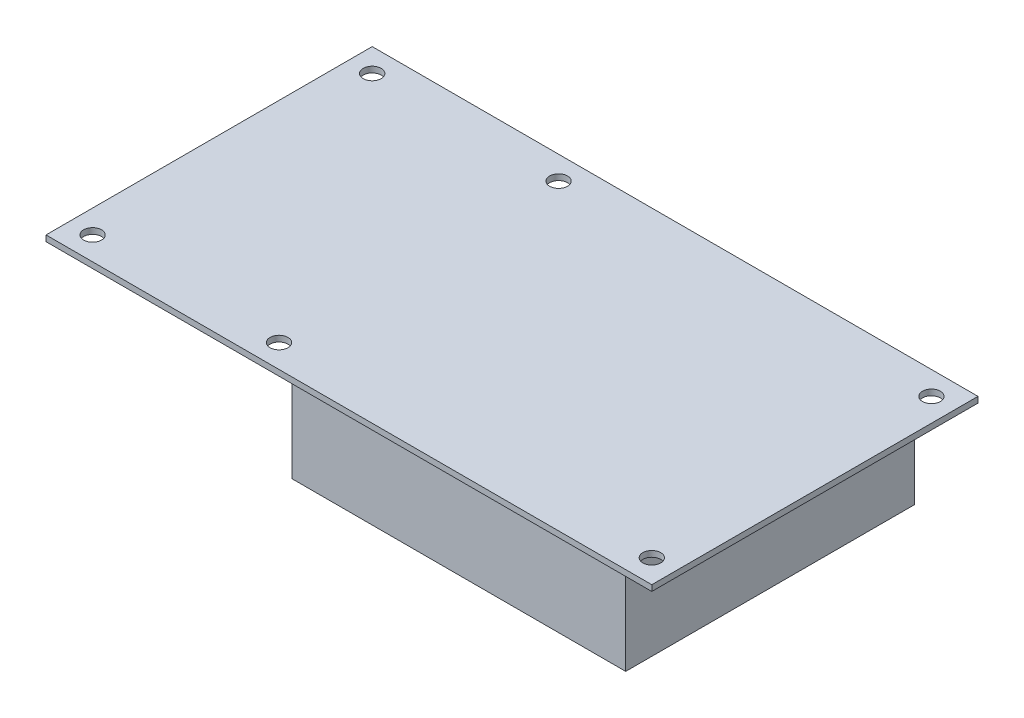
ISO-10303-21;
HEADER;
FILE_DESCRIPTION(('STEP AP214'),'2;1');
FILE_NAME('part.step','',(''),(''),'','','');
FILE_SCHEMA(('AUTOMOTIVE_DESIGN { 1 0 10303 214 1 1 1 1 }'));
ENDSEC;
DATA;
#1=APPLICATION_CONTEXT('core data for automotive mechanical design processes');
#2=APPLICATION_PROTOCOL_DEFINITION('international standard','automotive_design',2000,#1);
#3=PRODUCT_CONTEXT('',#1,'mechanical');
#4=PRODUCT('Part','Part','',(#3));
#5=PRODUCT_RELATED_PRODUCT_CATEGORY('part','',(#4));
#6=PRODUCT_DEFINITION_FORMATION('','',#4);
#7=PRODUCT_DEFINITION_CONTEXT('part definition',#1,'design');
#8=PRODUCT_DEFINITION('design','',#6,#7);
#9=PRODUCT_DEFINITION_SHAPE('','',#8);
#10=(LENGTH_UNIT() NAMED_UNIT(*) SI_UNIT(.MILLI.,.METRE.));
#11=(NAMED_UNIT(*) PLANE_ANGLE_UNIT() SI_UNIT($,.RADIAN.));
#12=(NAMED_UNIT(*) SI_UNIT($,.STERADIAN.) SOLID_ANGLE_UNIT());
#13=UNCERTAINTY_MEASURE_WITH_UNIT(LENGTH_MEASURE(1.E-05),#10,'distance_accuracy_value','');
#14=(GEOMETRIC_REPRESENTATION_CONTEXT(3) GLOBAL_UNCERTAINTY_ASSIGNED_CONTEXT((#13)) GLOBAL_UNIT_ASSIGNED_CONTEXT((#10,
#11,#12)) REPRESENTATION_CONTEXT('',''));
#15=CARTESIAN_POINT('',(0.,0.,0.));
#16=DIRECTION('',(0.,0.,1.));
#17=DIRECTION('',(1.,0.,0.));
#18=AXIS2_PLACEMENT_3D('',#15,#16,#17);
#19=CARTESIAN_POINT('',(0.,0.,-88.9));
#20=DIRECTION('',(0.,-1.,0.));
#21=DIRECTION('',(0.,0.,-1.));
#22=AXIS2_PLACEMENT_3D('',#19,#20,#21);
#23=PLANE('',#22);
#24=DIRECTION('',(0.,0.,1.));
#25=VECTOR('',#24,1.);
#26=CARTESIAN_POINT('',(0.,0.,0.));
#27=LINE('',#26,#25);
#28=CARTESIAN_POINT('',(0.,0.,-88.9));
#29=VERTEX_POINT('',#28);
#30=CARTESIAN_POINT('',(0.,0.,0.));
#31=VERTEX_POINT('',#30);
#32=EDGE_CURVE('E171',#29,#31,#27,.T.);
#33=ORIENTED_EDGE('',*,*,#32,.F.);
#34=DIRECTION('',(-1.,0.,0.));
#35=VECTOR('',#34,1.);
#36=CARTESIAN_POINT('',(0.,0.,-88.9));
#37=LINE('',#36,#35);
#38=CARTESIAN_POINT('',(165.1,0.,-88.9));
#39=VERTEX_POINT('',#38);
#40=EDGE_CURVE('E178',#39,#29,#37,.T.);
#41=ORIENTED_EDGE('',*,*,#40,.F.);
#42=DIRECTION('',(0.,0.,-1.));
#43=VECTOR('',#42,1.);
#44=CARTESIAN_POINT('',(165.1,0.,0.));
#45=LINE('',#44,#43);
#46=CARTESIAN_POINT('',(165.1,0.,0.));
#47=VERTEX_POINT('',#46);
#48=EDGE_CURVE('E176',#47,#39,#45,.T.);
#49=ORIENTED_EDGE('',*,*,#48,.F.);
#50=DIRECTION('',(1.,0.,0.));
#51=VECTOR('',#50,1.);
#52=CARTESIAN_POINT('',(0.,0.,0.));
#53=LINE('',#52,#51);
#54=EDGE_CURVE('E174',#31,#47,#53,.T.);
#55=ORIENTED_EDGE('',*,*,#54,.F.);
#56=EDGE_LOOP('',(#33,#41,#49,#55));
#57=FACE_BOUND('',#56,.T.);
#58=CARTESIAN_POINT('',(158.75,0.,-6.35));
#59=DIRECTION('',(0.,1.,0.));
#60=DIRECTION('',(0.,0.,1.));
#61=AXIS2_PLACEMENT_3D('',#58,#59,#60);
#62=CIRCLE('',#61,2.4384);
#63=CARTESIAN_POINT('',(158.75,0.,-3.9116));
#64=VERTEX_POINT('',#63);
#65=EDGE_CURVE('E168',#64,#64,#62,.T.);
#66=ORIENTED_EDGE('',*,*,#65,.T.);
#67=EDGE_LOOP('',(#66));
#68=FACE_BOUND('',#67,.T.);
#69=CARTESIAN_POINT('',(57.15,0.,-6.35));
#70=DIRECTION('',(0.,1.,0.));
#71=DIRECTION('',(0.,0.,1.));
#72=AXIS2_PLACEMENT_3D('',#69,#70,#71);
#73=CIRCLE('',#72,2.4384);
#74=CARTESIAN_POINT('',(57.15,0.,-3.9116));
#75=VERTEX_POINT('',#74);
#76=EDGE_CURVE('E162',#75,#75,#73,.T.);
#77=ORIENTED_EDGE('',*,*,#76,.T.);
#78=EDGE_LOOP('',(#77));
#79=FACE_BOUND('',#78,.T.);
#80=CARTESIAN_POINT('',(6.35000000000001,0.,-6.35));
#81=DIRECTION('',(0.,1.,0.));
#82=DIRECTION('',(0.,0.,1.));
#83=AXIS2_PLACEMENT_3D('',#80,#81,#82);
#84=CIRCLE('',#83,2.4384);
#85=CARTESIAN_POINT('',(6.35000000000001,0.,-3.9116));
#86=VERTEX_POINT('',#85);
#87=EDGE_CURVE('E156',#86,#86,#84,.T.);
#88=ORIENTED_EDGE('',*,*,#87,.T.);
#89=EDGE_LOOP('',(#88));
#90=FACE_BOUND('',#89,.T.);
#91=CARTESIAN_POINT('',(158.75,0.,-82.55));
#92=DIRECTION('',(0.,1.,0.));
#93=DIRECTION('',(0.,0.,1.));
#94=AXIS2_PLACEMENT_3D('',#91,#92,#93);
#95=CIRCLE('',#94,2.4384);
#96=CARTESIAN_POINT('',(158.75,0.,-80.1116));
#97=VERTEX_POINT('',#96);
#98=EDGE_CURVE('E150',#97,#97,#95,.T.);
#99=ORIENTED_EDGE('',*,*,#98,.T.);
#100=EDGE_LOOP('',(#99));
#101=FACE_BOUND('',#100,.T.);
#102=CARTESIAN_POINT('',(57.15,0.,-82.55));
#103=DIRECTION('',(0.,1.,0.));
#104=DIRECTION('',(0.,0.,1.));
#105=AXIS2_PLACEMENT_3D('',#102,#103,#104);
#106=CIRCLE('',#105,2.4384);
#107=CARTESIAN_POINT('',(57.15,0.,-80.1116));
#108=VERTEX_POINT('',#107);
#109=EDGE_CURVE('E144',#108,#108,#106,.T.);
#110=ORIENTED_EDGE('',*,*,#109,.T.);
#111=EDGE_LOOP('',(#110));
#112=FACE_BOUND('',#111,.T.);
#113=CARTESIAN_POINT('',(6.35000000000001,0.,-82.55));
#114=DIRECTION('',(0.,1.,0.));
#115=DIRECTION('',(0.,0.,1.));
#116=AXIS2_PLACEMENT_3D('',#113,#114,#115);
#117=CIRCLE('',#116,2.4384);
#118=CARTESIAN_POINT('',(6.35000000000001,0.,-80.1116));
#119=VERTEX_POINT('',#118);
#120=EDGE_CURVE('E138',#119,#119,#117,.T.);
#121=ORIENTED_EDGE('',*,*,#120,.T.);
#122=EDGE_LOOP('',(#121));
#123=FACE_BOUND('',#122,.T.);
#124=DIRECTION('',(1.,0.,0.));
#125=VECTOR('',#124,1.);
#126=CARTESIAN_POINT('',(62.484,0.,-83.312));
#127=LINE('',#126,#125);
#128=CARTESIAN_POINT('',(62.484,0.,-83.312));
#129=VERTEX_POINT('',#128);
#130=CARTESIAN_POINT('',(153.416,0.,-83.312));
#131=VERTEX_POINT('',#130);
#132=EDGE_CURVE('E101',#129,#131,#127,.T.);
#133=ORIENTED_EDGE('',*,*,#132,.F.);
#134=DIRECTION('',(0.,0.,-1.));
#135=VECTOR('',#134,1.);
#136=CARTESIAN_POINT('',(62.484,0.,-4.572));
#137=LINE('',#136,#135);
#138=CARTESIAN_POINT('',(62.484,0.,-4.572));
#139=VERTEX_POINT('',#138);
#140=EDGE_CURVE('E112',#139,#129,#137,.T.);
#141=ORIENTED_EDGE('',*,*,#140,.F.);
#142=DIRECTION('',(-1.,0.,0.));
#143=VECTOR('',#142,1.);
#144=CARTESIAN_POINT('',(62.484,0.,-4.572));
#145=LINE('',#144,#143);
#146=CARTESIAN_POINT('',(153.416,0.,-4.57200000000001));
#147=VERTEX_POINT('',#146);
#148=EDGE_CURVE('E122',#147,#139,#145,.T.);
#149=ORIENTED_EDGE('',*,*,#148,.F.);
#150=DIRECTION('',(0.,0.,1.));
#151=VECTOR('',#150,1.);
#152=CARTESIAN_POINT('',(153.416,0.,-4.572));
#153=LINE('',#152,#151);
#154=EDGE_CURVE('E120',#131,#147,#153,.T.);
#155=ORIENTED_EDGE('',*,*,#154,.F.);
#156=EDGE_LOOP('',(#133,#141,#149,#155));
#157=FACE_BOUND('',#156,.T.);
#158=ADVANCED_FACE('F30',(#57,#68,#79,#90,#101,#112,#123,#157),#23,.T.);
#159=CARTESIAN_POINT('',(0.,1.6002,0.));
#160=DIRECTION('',(1.,0.,0.));
#161=DIRECTION('',(0.,0.,-1.));
#162=AXIS2_PLACEMENT_3D('',#159,#160,#161);
#163=PLANE('',#162);
#164=ORIENTED_EDGE('',*,*,#32,.T.);
#165=DIRECTION('',(0.,-1.,0.));
#166=VECTOR('',#165,1.);
#167=CARTESIAN_POINT('',(0.,1.6002,0.));
#168=LINE('',#167,#166);
#169=CARTESIAN_POINT('',(0.,1.6002,0.));
#170=VERTEX_POINT('',#169);
#171=EDGE_CURVE('E11',#170,#31,#168,.T.);
#172=ORIENTED_EDGE('',*,*,#171,.F.);
#173=DIRECTION('',(0.,0.,1.));
#174=VECTOR('',#173,1.);
#175=CARTESIAN_POINT('',(0.,1.6002,0.));
#176=LINE('',#175,#174);
#177=CARTESIAN_POINT('',(0.,1.6002,-88.9));
#178=VERTEX_POINT('',#177);
#179=EDGE_CURVE('E180',#178,#170,#176,.T.);
#180=ORIENTED_EDGE('',*,*,#179,.F.);
#181=DIRECTION('',(0.,-1.,0.));
#182=VECTOR('',#181,1.);
#183=CARTESIAN_POINT('',(0.,1.6002,-88.9));
#184=LINE('',#183,#182);
#185=EDGE_CURVE('E187',#178,#29,#184,.T.);
#186=ORIENTED_EDGE('',*,*,#185,.T.);
#187=EDGE_LOOP('',(#164,#172,#180,#186));
#188=FACE_BOUND('',#187,.T.);
#189=ADVANCED_FACE('F32',(#188),#163,.F.);
#190=CARTESIAN_POINT('',(0.,1.6002,0.));
#191=DIRECTION('',(0.,0.,-1.));
#192=DIRECTION('',(-1.,0.,0.));
#193=AXIS2_PLACEMENT_3D('',#190,#191,#192);
#194=PLANE('',#193);
#195=ORIENTED_EDGE('',*,*,#54,.T.);
#196=DIRECTION('',(0.,-1.,0.));
#197=VECTOR('',#196,1.);
#198=CARTESIAN_POINT('',(165.1,1.6002,0.));
#199=LINE('',#198,#197);
#200=CARTESIAN_POINT('',(165.1,1.6002,0.));
#201=VERTEX_POINT('',#200);
#202=EDGE_CURVE('E38',#201,#47,#199,.T.);
#203=ORIENTED_EDGE('',*,*,#202,.F.);
#204=DIRECTION('',(1.,0.,0.));
#205=VECTOR('',#204,1.);
#206=CARTESIAN_POINT('',(0.,1.6002,0.));
#207=LINE('',#206,#205);
#208=EDGE_CURVE('E182',#170,#201,#207,.T.);
#209=ORIENTED_EDGE('',*,*,#208,.F.);
#210=ORIENTED_EDGE('',*,*,#171,.T.);
#211=EDGE_LOOP('',(#195,#203,#209,#210));
#212=FACE_BOUND('',#211,.T.);
#213=ADVANCED_FACE('F210',(#212),#194,.F.);
#214=CARTESIAN_POINT('',(165.1,1.6002,0.));
#215=DIRECTION('',(-1.,0.,0.));
#216=DIRECTION('',(0.,0.,1.));
#217=AXIS2_PLACEMENT_3D('',#214,#215,#216);
#218=PLANE('',#217);
#219=ORIENTED_EDGE('',*,*,#48,.T.);
#220=DIRECTION('',(0.,-1.,0.));
#221=VECTOR('',#220,1.);
#222=CARTESIAN_POINT('',(165.1,1.6002,-88.9));
#223=LINE('',#222,#221);
#224=CARTESIAN_POINT('',(165.1,1.6002,-88.9));
#225=VERTEX_POINT('',#224);
#226=EDGE_CURVE('E190',#225,#39,#223,.T.);
#227=ORIENTED_EDGE('',*,*,#226,.F.);
#228=DIRECTION('',(0.,0.,-1.));
#229=VECTOR('',#228,1.);
#230=CARTESIAN_POINT('',(165.1,1.6002,0.));
#231=LINE('',#230,#229);
#232=EDGE_CURVE('E184',#201,#225,#231,.T.);
#233=ORIENTED_EDGE('',*,*,#232,.F.);
#234=ORIENTED_EDGE('',*,*,#202,.T.);
#235=EDGE_LOOP('',(#219,#227,#233,#234));
#236=FACE_BOUND('',#235,.T.);
#237=ADVANCED_FACE('F197',(#236),#218,.F.);
#238=CARTESIAN_POINT('',(0.,1.6002,-88.9));
#239=DIRECTION('',(0.,0.,1.));
#240=DIRECTION('',(1.,0.,0.));
#241=AXIS2_PLACEMENT_3D('',#238,#239,#240);
#242=PLANE('',#241);
#243=ORIENTED_EDGE('',*,*,#40,.T.);
#244=ORIENTED_EDGE('',*,*,#185,.F.);
#245=DIRECTION('',(-1.,0.,0.));
#246=VECTOR('',#245,1.);
#247=CARTESIAN_POINT('',(0.,1.6002,-88.9));
#248=LINE('',#247,#246);
#249=EDGE_CURVE('E53',#225,#178,#248,.T.);
#250=ORIENTED_EDGE('',*,*,#249,.F.);
#251=ORIENTED_EDGE('',*,*,#226,.T.);
#252=EDGE_LOOP('',(#243,#244,#250,#251));
#253=FACE_BOUND('',#252,.T.);
#254=ADVANCED_FACE('F205',(#253),#242,.F.);
#255=CARTESIAN_POINT('',(0.,1.6002,-88.9));
#256=DIRECTION('',(0.,-1.,0.));
#257=DIRECTION('',(0.,0.,-1.));
#258=AXIS2_PLACEMENT_3D('',#255,#256,#257);
#259=PLANE('',#258);
#260=CARTESIAN_POINT('',(6.35000000000001,1.6002,-82.55));
#261=DIRECTION('',(0.,1.,0.));
#262=DIRECTION('',(0.,0.,1.));
#263=AXIS2_PLACEMENT_3D('',#260,#261,#262);
#264=CIRCLE('',#263,2.4384);
#265=CARTESIAN_POINT('',(6.35000000000001,1.6002,-80.1116));
#266=VERTEX_POINT('',#265);
#267=EDGE_CURVE('E107',#266,#266,#264,.T.);
#268=ORIENTED_EDGE('',*,*,#267,.F.);
#269=EDGE_LOOP('',(#268));
#270=FACE_BOUND('',#269,.T.);
#271=CARTESIAN_POINT('',(57.15,1.6002,-82.55));
#272=DIRECTION('',(0.,1.,0.));
#273=DIRECTION('',(0.,0.,1.));
#274=AXIS2_PLACEMENT_3D('',#271,#272,#273);
#275=CIRCLE('',#274,2.4384);
#276=CARTESIAN_POINT('',(57.15,1.6002,-80.1116));
#277=VERTEX_POINT('',#276);
#278=EDGE_CURVE('E141',#277,#277,#275,.T.);
#279=ORIENTED_EDGE('',*,*,#278,.F.);
#280=EDGE_LOOP('',(#279));
#281=FACE_BOUND('',#280,.T.);
#282=CARTESIAN_POINT('',(158.75,1.6002,-82.55));
#283=DIRECTION('',(0.,1.,0.));
#284=DIRECTION('',(0.,0.,1.));
#285=AXIS2_PLACEMENT_3D('',#282,#283,#284);
#286=CIRCLE('',#285,2.4384);
#287=CARTESIAN_POINT('',(158.75,1.6002,-80.1116));
#288=VERTEX_POINT('',#287);
#289=EDGE_CURVE('E147',#288,#288,#286,.T.);
#290=ORIENTED_EDGE('',*,*,#289,.F.);
#291=EDGE_LOOP('',(#290));
#292=FACE_BOUND('',#291,.T.);
#293=CARTESIAN_POINT('',(6.35000000000001,1.6002,-6.35));
#294=DIRECTION('',(0.,1.,0.));
#295=DIRECTION('',(0.,0.,1.));
#296=AXIS2_PLACEMENT_3D('',#293,#294,#295);
#297=CIRCLE('',#296,2.4384);
#298=CARTESIAN_POINT('',(6.35000000000001,1.6002,-3.9116));
#299=VERTEX_POINT('',#298);
#300=EDGE_CURVE('E153',#299,#299,#297,.T.);
#301=ORIENTED_EDGE('',*,*,#300,.F.);
#302=EDGE_LOOP('',(#301));
#303=FACE_BOUND('',#302,.T.);
#304=CARTESIAN_POINT('',(57.15,1.6002,-6.35));
#305=DIRECTION('',(0.,1.,0.));
#306=DIRECTION('',(0.,0.,1.));
#307=AXIS2_PLACEMENT_3D('',#304,#305,#306);
#308=CIRCLE('',#307,2.4384);
#309=CARTESIAN_POINT('',(57.15,1.6002,-3.9116));
#310=VERTEX_POINT('',#309);
#311=EDGE_CURVE('E159',#310,#310,#308,.T.);
#312=ORIENTED_EDGE('',*,*,#311,.F.);
#313=EDGE_LOOP('',(#312));
#314=FACE_BOUND('',#313,.T.);
#315=CARTESIAN_POINT('',(158.75,1.6002,-6.35));
#316=DIRECTION('',(0.,1.,0.));
#317=DIRECTION('',(0.,0.,1.));
#318=AXIS2_PLACEMENT_3D('',#315,#316,#317);
#319=CIRCLE('',#318,2.4384);
#320=CARTESIAN_POINT('',(158.75,1.6002,-3.9116));
#321=VERTEX_POINT('',#320);
#322=EDGE_CURVE('E165',#321,#321,#319,.T.);
#323=ORIENTED_EDGE('',*,*,#322,.F.);
#324=EDGE_LOOP('',(#323));
#325=FACE_BOUND('',#324,.T.);
#326=ORIENTED_EDGE('',*,*,#179,.T.);
#327=ORIENTED_EDGE('',*,*,#208,.T.);
#328=ORIENTED_EDGE('',*,*,#232,.T.);
#329=ORIENTED_EDGE('',*,*,#249,.T.);
#330=EDGE_LOOP('',(#326,#327,#328,#329));
#331=FACE_BOUND('',#330,.T.);
#332=ADVANCED_FACE('F209',(#270,#281,#292,#303,#314,#325,#331),#259,.F.);
#333=CARTESIAN_POINT('',(158.75,0.,-6.35));
#334=DIRECTION('',(0.,1.,0.));
#335=DIRECTION('',(0.,0.,1.));
#336=AXIS2_PLACEMENT_3D('',#333,#334,#335);
#337=CYLINDRICAL_SURFACE('',#336,2.4384);
#338=ORIENTED_EDGE('',*,*,#65,.F.);
#339=EDGE_LOOP('',(#338));
#340=FACE_BOUND('',#339,.T.);
#341=ORIENTED_EDGE('',*,*,#322,.T.);
#342=EDGE_LOOP('',(#341));
#343=FACE_BOUND('',#342,.T.);
#344=ADVANCED_FACE('F223',(#340,#343),#337,.F.);
#345=CARTESIAN_POINT('',(57.15,0.,-6.35));
#346=DIRECTION('',(0.,1.,0.));
#347=DIRECTION('',(0.,0.,1.));
#348=AXIS2_PLACEMENT_3D('',#345,#346,#347);
#349=CYLINDRICAL_SURFACE('',#348,2.4384);
#350=ORIENTED_EDGE('',*,*,#76,.F.);
#351=EDGE_LOOP('',(#350));
#352=FACE_BOUND('',#351,.T.);
#353=ORIENTED_EDGE('',*,*,#311,.T.);
#354=EDGE_LOOP('',(#353));
#355=FACE_BOUND('',#354,.T.);
#356=ADVANCED_FACE('F243',(#352,#355),#349,.F.);
#357=CARTESIAN_POINT('',(6.35000000000001,0.,-6.35));
#358=DIRECTION('',(0.,1.,0.));
#359=DIRECTION('',(0.,0.,1.));
#360=AXIS2_PLACEMENT_3D('',#357,#358,#359);
#361=CYLINDRICAL_SURFACE('',#360,2.4384);
#362=ORIENTED_EDGE('',*,*,#87,.F.);
#363=EDGE_LOOP('',(#362));
#364=FACE_BOUND('',#363,.T.);
#365=ORIENTED_EDGE('',*,*,#300,.T.);
#366=EDGE_LOOP('',(#365));
#367=FACE_BOUND('',#366,.T.);
#368=ADVANCED_FACE('F250',(#364,#367),#361,.F.);
#369=CARTESIAN_POINT('',(158.75,0.,-82.55));
#370=DIRECTION('',(0.,1.,0.));
#371=DIRECTION('',(0.,0.,1.));
#372=AXIS2_PLACEMENT_3D('',#369,#370,#371);
#373=CYLINDRICAL_SURFACE('',#372,2.4384);
#374=ORIENTED_EDGE('',*,*,#98,.F.);
#375=EDGE_LOOP('',(#374));
#376=FACE_BOUND('',#375,.T.);
#377=ORIENTED_EDGE('',*,*,#289,.T.);
#378=EDGE_LOOP('',(#377));
#379=FACE_BOUND('',#378,.T.);
#380=ADVANCED_FACE('F257',(#376,#379),#373,.F.);
#381=CARTESIAN_POINT('',(57.15,0.,-82.55));
#382=DIRECTION('',(0.,1.,0.));
#383=DIRECTION('',(0.,0.,1.));
#384=AXIS2_PLACEMENT_3D('',#381,#382,#383);
#385=CYLINDRICAL_SURFACE('',#384,2.4384);
#386=ORIENTED_EDGE('',*,*,#109,.F.);
#387=EDGE_LOOP('',(#386));
#388=FACE_BOUND('',#387,.T.);
#389=ORIENTED_EDGE('',*,*,#278,.T.);
#390=EDGE_LOOP('',(#389));
#391=FACE_BOUND('',#390,.T.);
#392=ADVANCED_FACE('F265',(#388,#391),#385,.F.);
#393=CARTESIAN_POINT('',(6.35000000000001,0.,-82.55));
#394=DIRECTION('',(0.,1.,0.));
#395=DIRECTION('',(0.,0.,1.));
#396=AXIS2_PLACEMENT_3D('',#393,#394,#395);
#397=CYLINDRICAL_SURFACE('',#396,2.4384);
#398=ORIENTED_EDGE('',*,*,#120,.F.);
#399=EDGE_LOOP('',(#398));
#400=FACE_BOUND('',#399,.T.);
#401=ORIENTED_EDGE('',*,*,#267,.T.);
#402=EDGE_LOOP('',(#401));
#403=FACE_BOUND('',#402,.T.);
#404=ADVANCED_FACE('F273',(#400,#403),#397,.F.);
#405=CARTESIAN_POINT('',(62.484,-27.0002,-4.572));
#406=DIRECTION('',(1.,0.,0.));
#407=DIRECTION('',(0.,0.,-1.));
#408=AXIS2_PLACEMENT_3D('',#405,#406,#407);
#409=PLANE('',#408);
#410=ORIENTED_EDGE('',*,*,#140,.T.);
#411=DIRECTION('',(0.,1.,0.));
#412=VECTOR('',#411,1.);
#413=CARTESIAN_POINT('',(62.484,-27.0002,-83.312));
#414=LINE('',#413,#412);
#415=CARTESIAN_POINT('',(62.484,-27.0002,-83.312));
#416=VERTEX_POINT('',#415);
#417=EDGE_CURVE('E96',#416,#129,#414,.T.);
#418=ORIENTED_EDGE('',*,*,#417,.F.);
#419=DIRECTION('',(0.,0.,-1.));
#420=VECTOR('',#419,1.);
#421=CARTESIAN_POINT('',(62.484,-27.0002,-4.572));
#422=LINE('',#421,#420);
#423=CARTESIAN_POINT('',(62.484,-27.0002,-4.572));
#424=VERTEX_POINT('',#423);
#425=EDGE_CURVE('E126',#424,#416,#422,.T.);
#426=ORIENTED_EDGE('',*,*,#425,.F.);
#427=DIRECTION('',(0.,1.,0.));
#428=VECTOR('',#427,1.);
#429=CARTESIAN_POINT('',(62.484,-27.0002,-4.572));
#430=LINE('',#429,#428);
#431=EDGE_CURVE('E115',#424,#139,#430,.T.);
#432=ORIENTED_EDGE('',*,*,#431,.T.);
#433=EDGE_LOOP('',(#410,#418,#426,#432));
#434=FACE_BOUND('',#433,.T.);
#435=ADVANCED_FACE('F113',(#434),#409,.F.);
#436=CARTESIAN_POINT('',(62.484,-27.0002,-83.312));
#437=DIRECTION('',(0.,0.,1.));
#438=DIRECTION('',(1.,0.,0.));
#439=AXIS2_PLACEMENT_3D('',#436,#437,#438);
#440=PLANE('',#439);
#441=ORIENTED_EDGE('',*,*,#132,.T.);
#442=DIRECTION('',(0.,1.,0.));
#443=VECTOR('',#442,1.);
#444=CARTESIAN_POINT('',(153.416,-27.0002,-83.312));
#445=LINE('',#444,#443);
#446=CARTESIAN_POINT('',(153.416,-27.0002,-83.312));
#447=VERTEX_POINT('',#446);
#448=EDGE_CURVE('E108',#447,#131,#445,.T.);
#449=ORIENTED_EDGE('',*,*,#448,.F.);
#450=DIRECTION('',(1.,0.,0.));
#451=VECTOR('',#450,1.);
#452=CARTESIAN_POINT('',(62.484,-27.0002,-83.312));
#453=LINE('',#452,#451);
#454=EDGE_CURVE('E103',#416,#447,#453,.T.);
#455=ORIENTED_EDGE('',*,*,#454,.F.);
#456=ORIENTED_EDGE('',*,*,#417,.T.);
#457=EDGE_LOOP('',(#441,#449,#455,#456));
#458=FACE_BOUND('',#457,.T.);
#459=ADVANCED_FACE('F98',(#458),#440,.F.);
#460=CARTESIAN_POINT('',(153.416,-27.0002,-4.572));
#461=DIRECTION('',(-1.,0.,0.));
#462=DIRECTION('',(0.,0.,1.));
#463=AXIS2_PLACEMENT_3D('',#460,#461,#462);
#464=PLANE('',#463);
#465=ORIENTED_EDGE('',*,*,#154,.T.);
#466=DIRECTION('',(0.,1.,0.));
#467=VECTOR('',#466,1.);
#468=CARTESIAN_POINT('',(153.416,-27.0002,-4.572));
#469=LINE('',#468,#467);
#470=CARTESIAN_POINT('',(153.416,-27.0002,-4.572));
#471=VERTEX_POINT('',#470);
#472=EDGE_CURVE('E45',#471,#147,#469,.T.);
#473=ORIENTED_EDGE('',*,*,#472,.F.);
#474=DIRECTION('',(0.,0.,1.));
#475=VECTOR('',#474,1.);
#476=CARTESIAN_POINT('',(153.416,-27.0002,-4.572));
#477=LINE('',#476,#475);
#478=EDGE_CURVE('E129',#447,#471,#477,.T.);
#479=ORIENTED_EDGE('',*,*,#478,.F.);
#480=ORIENTED_EDGE('',*,*,#448,.T.);
#481=EDGE_LOOP('',(#465,#473,#479,#480));
#482=FACE_BOUND('',#481,.T.);
#483=ADVANCED_FACE('F294',(#482),#464,.F.);
#484=CARTESIAN_POINT('',(62.484,-27.0002,-4.572));
#485=DIRECTION('',(0.,0.,-1.));
#486=DIRECTION('',(-1.,0.,0.));
#487=AXIS2_PLACEMENT_3D('',#484,#485,#486);
#488=PLANE('',#487);
#489=ORIENTED_EDGE('',*,*,#148,.T.);
#490=ORIENTED_EDGE('',*,*,#431,.F.);
#491=DIRECTION('',(-1.,0.,0.));
#492=VECTOR('',#491,1.);
#493=CARTESIAN_POINT('',(62.484,-27.0002,-4.572));
#494=LINE('',#493,#492);
#495=EDGE_CURVE('E131',#471,#424,#494,.T.);
#496=ORIENTED_EDGE('',*,*,#495,.F.);
#497=ORIENTED_EDGE('',*,*,#472,.T.);
#498=EDGE_LOOP('',(#489,#490,#496,#497));
#499=FACE_BOUND('',#498,.T.);
#500=ADVANCED_FACE('F301',(#499),#488,.F.);
#501=CARTESIAN_POINT('',(62.484,-27.0002,-83.312));
#502=DIRECTION('',(0.,-1.,0.));
#503=DIRECTION('',(0.,0.,-1.));
#504=AXIS2_PLACEMENT_3D('',#501,#502,#503);
#505=PLANE('',#504);
#506=ORIENTED_EDGE('',*,*,#425,.T.);
#507=ORIENTED_EDGE('',*,*,#454,.T.);
#508=ORIENTED_EDGE('',*,*,#478,.T.);
#509=ORIENTED_EDGE('',*,*,#495,.T.);
#510=EDGE_LOOP('',(#506,#507,#508,#509));
#511=FACE_BOUND('',#510,.T.);
#512=ADVANCED_FACE('F309',(#511),#505,.T.);
#513=CLOSED_SHELL('',(#158,#189,#213,#237,#254,#332,#344,#356,#368,#380,#392,#404,#435,#459,
#483,#500,#512));
#514=MANIFOLD_SOLID_BREP('B2',#513);
#515=ADVANCED_BREP_SHAPE_REPRESENTATION('',(#18,#514),#14);
#516=SHAPE_DEFINITION_REPRESENTATION(#9,#515);
ENDSEC;
END-ISO-10303-21;
